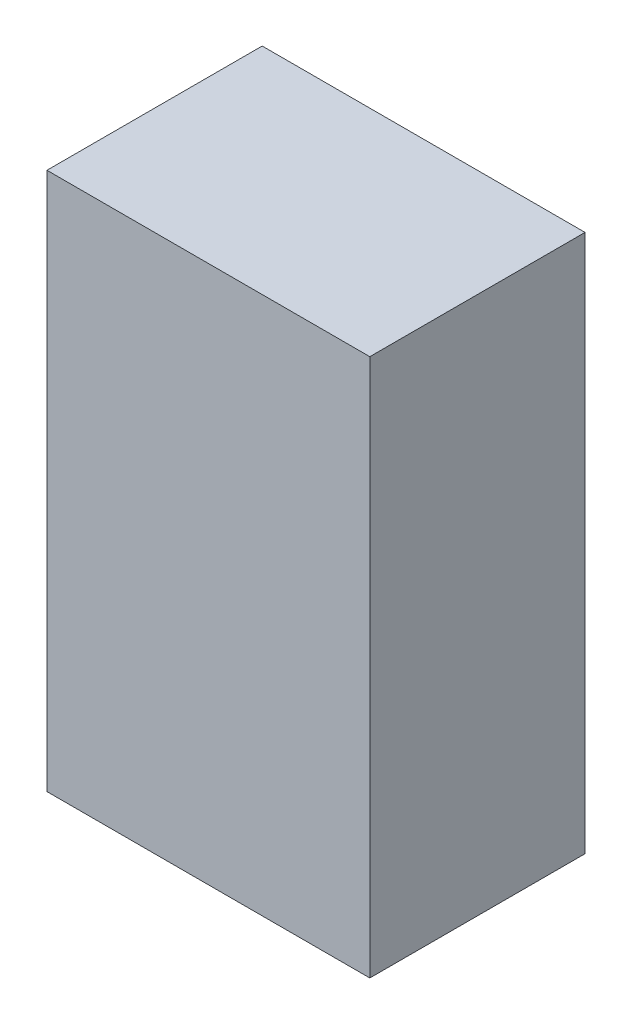
ISO-10303-21;
HEADER;
FILE_DESCRIPTION(('STEP AP214'),'2;1');
FILE_NAME('part.step','',(''),(''),'','','');
FILE_SCHEMA(('AUTOMOTIVE_DESIGN { 1 0 10303 214 1 1 1 1 }'));
ENDSEC;
DATA;
#1=APPLICATION_CONTEXT('core data for automotive mechanical design processes');
#2=APPLICATION_PROTOCOL_DEFINITION('international standard','automotive_design',2000,#1);
#3=PRODUCT_CONTEXT('',#1,'mechanical');
#4=PRODUCT('Part','Part','',(#3));
#5=PRODUCT_RELATED_PRODUCT_CATEGORY('part','',(#4));
#6=PRODUCT_DEFINITION_FORMATION('','',#4);
#7=PRODUCT_DEFINITION_CONTEXT('part definition',#1,'design');
#8=PRODUCT_DEFINITION('design','',#6,#7);
#9=PRODUCT_DEFINITION_SHAPE('','',#8);
#10=(LENGTH_UNIT() NAMED_UNIT(*) SI_UNIT(.MILLI.,.METRE.));
#11=(NAMED_UNIT(*) PLANE_ANGLE_UNIT() SI_UNIT($,.RADIAN.));
#12=(NAMED_UNIT(*) SI_UNIT($,.STERADIAN.) SOLID_ANGLE_UNIT());
#13=UNCERTAINTY_MEASURE_WITH_UNIT(LENGTH_MEASURE(1.E-05),#10,'distance_accuracy_value','');
#14=(GEOMETRIC_REPRESENTATION_CONTEXT(3) GLOBAL_UNCERTAINTY_ASSIGNED_CONTEXT((#13)) GLOBAL_UNIT_ASSIGNED_CONTEXT((#10,
#11,#12)) REPRESENTATION_CONTEXT('',''));
#15=CARTESIAN_POINT('',(0.,0.,0.));
#16=DIRECTION('',(0.,0.,1.));
#17=DIRECTION('',(1.,0.,0.));
#18=AXIS2_PLACEMENT_3D('',#15,#16,#17);
#19=CARTESIAN_POINT('',(1.650000000004,7.7216,0.77916));
#20=DIRECTION('',(2.05103E-10,0.,-1.));
#21=DIRECTION('',(-1.,0.,-2.05103E-10));
#22=AXIS2_PLACEMENT_3D('',#19,#20,#21);
#23=PLANE('',#22);
#24=DIRECTION('',(1.,0.,0.));
#25=VECTOR('',#24,1.);
#26=CARTESIAN_POINT('',(1.400000000004,8.1716,0.779159999969));
#27=LINE('',#26,#25);
#28=CARTESIAN_POINT('',(1.50000000000205,8.1716,0.779159999969));
#29=VERTEX_POINT('',#28);
#30=CARTESIAN_POINT('',(1.800000000004,8.1716,0.779159999999745));
#31=VERTEX_POINT('',#30);
#32=EDGE_CURVE('E156',#29,#31,#27,.T.);
#33=ORIENTED_EDGE('',*,*,#32,.T.);
#34=CARTESIAN_POINT('',(1.800000000004,8.0716,0.77916000003049));
#35=DIRECTION('',(2.05103E-10,0.,-1.));
#36=DIRECTION('',(-1.,0.,-2.05103E-10));
#37=AXIS2_PLACEMENT_3D('',#34,#35,#36);
#38=CIRCLE('',#37,0.1);
#39=CARTESIAN_POINT('',(1.900000000004,8.0716,0.779160000051));
#40=VERTEX_POINT('',#39);
#41=EDGE_CURVE('E20',#40,#31,#38,.F.);
#42=ORIENTED_EDGE('',*,*,#41,.F.);
#43=DIRECTION('',(0.,1.,0.));
#44=VECTOR('',#43,1.);
#45=CARTESIAN_POINT('',(1.900000000004,8.1716,0.779160000051));
#46=LINE('',#45,#44);
#47=CARTESIAN_POINT('',(1.900000000004,8.0216,0.779160000051255));
#48=VERTEX_POINT('',#47);
#49=EDGE_CURVE('E153',#40,#48,#46,.F.);
#50=ORIENTED_EDGE('',*,*,#49,.T.);
#51=CARTESIAN_POINT('',(1.800000000004,8.0216,0.779160000031));
#52=DIRECTION('',(2.05103E-10,0.,-1.));
#53=DIRECTION('',(-1.,0.,-2.05103E-10));
#54=AXIS2_PLACEMENT_3D('',#51,#52,#53);
#55=CIRCLE('',#54,0.1);
#56=CARTESIAN_POINT('',(1.80000000000205,7.9216,0.779160000031));
#57=VERTEX_POINT('',#56);
#58=EDGE_CURVE('E171',#57,#48,#55,.F.);
#59=ORIENTED_EDGE('',*,*,#58,.F.);
#60=DIRECTION('',(-1.,0.,0.));
#61=VECTOR('',#60,1.);
#62=CARTESIAN_POINT('',(1.400000000004,7.9216,0.779160000031));
#63=LINE('',#62,#61);
#64=CARTESIAN_POINT('',(1.500000000004,7.9216,0.779160000000255));
#65=VERTEX_POINT('',#64);
#66=EDGE_CURVE('E175',#57,#65,#63,.T.);
#67=ORIENTED_EDGE('',*,*,#66,.T.);
#68=CARTESIAN_POINT('',(1.500000000004,8.0216,0.77915999996951));
#69=DIRECTION('',(2.05103E-10,0.,-1.));
#70=DIRECTION('',(-1.,0.,-2.05103E-10));
#71=AXIS2_PLACEMENT_3D('',#68,#69,#70);
#72=CIRCLE('',#71,0.1);
#73=CARTESIAN_POINT('',(1.400000000004,8.0216,0.779159999949));
#74=VERTEX_POINT('',#73);
#75=EDGE_CURVE('E225',#74,#65,#72,.F.);
#76=ORIENTED_EDGE('',*,*,#75,.F.);
#77=DIRECTION('',(0.,1.,0.));
#78=VECTOR('',#77,1.);
#79=CARTESIAN_POINT('',(1.400000000004,8.1716,0.779159999949));
#80=LINE('',#79,#78);
#81=CARTESIAN_POINT('',(1.400000000004,8.0716,0.779159999948745));
#82=VERTEX_POINT('',#81);
#83=EDGE_CURVE('E224',#74,#82,#80,.T.);
#84=ORIENTED_EDGE('',*,*,#83,.T.);
#85=CARTESIAN_POINT('',(1.500000000004,8.0716,0.779159999969));
#86=DIRECTION('',(2.05103E-10,0.,-1.));
#87=DIRECTION('',(-1.,0.,-2.05103E-10));
#88=AXIS2_PLACEMENT_3D('',#85,#86,#87);
#89=CIRCLE('',#88,0.1);
#90=EDGE_CURVE('E220',#29,#82,#89,.F.);
#91=ORIENTED_EDGE('',*,*,#90,.F.);
#92=EDGE_LOOP('',(#33,#42,#50,#59,#67,#76,#84,#91));
#93=FACE_BOUND('',#92,.T.);
#94=ADVANCED_FACE('F17',(#93),#23,.T.);
#95=CARTESIAN_POINT('',(1.650000000004,7.7216,0.77916));
#96=DIRECTION('',(-2.05103E-10,0.,1.));
#97=DIRECTION('',(1.,0.,2.05103E-10));
#98=AXIS2_PLACEMENT_3D('',#95,#96,#97);
#99=PLANE('',#98);
#100=CARTESIAN_POINT('',(1.500000000004,7.3716,0.77915999996951));
#101=DIRECTION('',(2.05103E-10,0.,-1.));
#102=DIRECTION('',(-1.,0.,-2.05103E-10));
#103=AXIS2_PLACEMENT_3D('',#100,#101,#102);
#104=CIRCLE('',#103,0.1);
#105=CARTESIAN_POINT('',(1.400000000004,7.3716,0.779159999949));
#106=VERTEX_POINT('',#105);
#107=CARTESIAN_POINT('',(1.500000000004,7.2716,0.779160000000255));
#108=VERTEX_POINT('',#107);
#109=EDGE_CURVE('E216',#106,#108,#104,.F.);
#110=ORIENTED_EDGE('',*,*,#109,.F.);
#111=DIRECTION('',(0.,1.,0.));
#112=VECTOR('',#111,1.);
#113=CARTESIAN_POINT('',(1.400000000004,7.2716,0.779159999949));
#114=LINE('',#113,#112);
#115=CARTESIAN_POINT('',(1.400000000004,7.4216,0.779159999948745));
#116=VERTEX_POINT('',#115);
#117=EDGE_CURVE('E215',#106,#116,#114,.T.);
#118=ORIENTED_EDGE('',*,*,#117,.T.);
#119=CARTESIAN_POINT('',(1.500000000004,7.4216,0.779159999969));
#120=DIRECTION('',(2.05103E-10,0.,-1.));
#121=DIRECTION('',(-1.,0.,-2.05103E-10));
#122=AXIS2_PLACEMENT_3D('',#119,#120,#121);
#123=CIRCLE('',#122,0.1);
#124=CARTESIAN_POINT('',(1.50000000000205,7.5216,0.779159999969));
#125=VERTEX_POINT('',#124);
#126=EDGE_CURVE('E211',#125,#116,#123,.F.);
#127=ORIENTED_EDGE('',*,*,#126,.F.);
#128=DIRECTION('',(1.,0.,0.));
#129=VECTOR('',#128,1.);
#130=CARTESIAN_POINT('',(1.400000000004,7.5216,0.779159999969));
#131=LINE('',#130,#129);
#132=CARTESIAN_POINT('',(1.800000000004,7.5216,0.779159999999745));
#133=VERTEX_POINT('',#132);
#134=EDGE_CURVE('E210',#125,#133,#131,.T.);
#135=ORIENTED_EDGE('',*,*,#134,.T.);
#136=CARTESIAN_POINT('',(1.800000000004,7.4216,0.77916000003049));
#137=DIRECTION('',(2.05103E-10,0.,-1.));
#138=DIRECTION('',(-1.,0.,-2.05103E-10));
#139=AXIS2_PLACEMENT_3D('',#136,#137,#138);
#140=CIRCLE('',#139,0.1);
#141=CARTESIAN_POINT('',(1.900000000004,7.4216,0.779160000051));
#142=VERTEX_POINT('',#141);
#143=EDGE_CURVE('E206',#142,#133,#140,.F.);
#144=ORIENTED_EDGE('',*,*,#143,.F.);
#145=DIRECTION('',(0.,1.,0.));
#146=VECTOR('',#145,1.);
#147=CARTESIAN_POINT('',(1.900000000004,7.2716,0.779160000051));
#148=LINE('',#147,#146);
#149=CARTESIAN_POINT('',(1.900000000004,7.3716,0.779160000051255));
#150=VERTEX_POINT('',#149);
#151=EDGE_CURVE('E205',#142,#150,#148,.F.);
#152=ORIENTED_EDGE('',*,*,#151,.T.);
#153=CARTESIAN_POINT('',(1.800000000004,7.3716,0.779160000031));
#154=DIRECTION('',(2.05103E-10,0.,-1.));
#155=DIRECTION('',(-1.,0.,-2.05103E-10));
#156=AXIS2_PLACEMENT_3D('',#153,#154,#155);
#157=CIRCLE('',#156,0.1);
#158=CARTESIAN_POINT('',(1.80000000000205,7.2716,0.779160000031));
#159=VERTEX_POINT('',#158);
#160=EDGE_CURVE('E201',#159,#150,#157,.F.);
#161=ORIENTED_EDGE('',*,*,#160,.F.);
#162=DIRECTION('',(1.,0.,0.));
#163=VECTOR('',#162,1.);
#164=CARTESIAN_POINT('',(1.400000000004,7.2716,0.779160000031));
#165=LINE('',#164,#163);
#166=EDGE_CURVE('E243',#159,#108,#165,.F.);
#167=ORIENTED_EDGE('',*,*,#166,.T.);
#168=EDGE_LOOP('',(#110,#118,#127,#135,#144,#152,#161,#167));
#169=FACE_BOUND('',#168,.T.);
#170=ADVANCED_FACE('F522',(#169),#99,.F.);
#171=CARTESIAN_POINT('',(1.800000000004,8.0716,0.779160000031));
#172=DIRECTION('',(2.05103E-10,0.,-1.));
#173=DIRECTION('',(-1.,0.,-2.05103E-10));
#174=AXIS2_PLACEMENT_3D('',#171,#172,#173);
#175=CYLINDRICAL_SURFACE('',#174,0.1);
#176=CARTESIAN_POINT('',(1.7999999999999,8.0716,0.799160000031));
#177=DIRECTION('',(2.05103E-10,0.,-1.));
#178=DIRECTION('',(-1.,0.,-2.05103E-10));
#179=AXIS2_PLACEMENT_3D('',#176,#177,#178);
#180=CIRCLE('',#179,0.1);
#181=CARTESIAN_POINT('',(1.80000000000195,8.1716,0.799160000030883));
#182=VERTEX_POINT('',#181);
#183=CARTESIAN_POINT('',(1.89999999999992,8.0716,0.799160000051393));
#184=VERTEX_POINT('',#183);
#185=EDGE_CURVE('E163',#182,#184,#180,.T.);
#186=ORIENTED_EDGE('',*,*,#185,.T.);
#187=DIRECTION('',(-2.05103E-10,0.,1.));
#188=VECTOR('',#187,1.);
#189=CARTESIAN_POINT('',(1.900000000004,8.0716,0.779160000051));
#190=LINE('',#189,#188);
#191=EDGE_CURVE('E159',#184,#40,#190,.F.);
#192=ORIENTED_EDGE('',*,*,#191,.T.);
#193=ORIENTED_EDGE('',*,*,#41,.T.);
#194=DIRECTION('',(0.,0.,-1.));
#195=VECTOR('',#194,1.);
#196=CARTESIAN_POINT('',(1.800000000004,8.1716,0.779159999949));
#197=LINE('',#196,#195);
#198=EDGE_CURVE('E258',#31,#182,#197,.F.);
#199=ORIENTED_EDGE('',*,*,#198,.T.);
#200=EDGE_LOOP('',(#186,#192,#193,#199));
#201=FACE_BOUND('',#200,.T.);
#202=ADVANCED_FACE('F161',(#201),#175,.T.);
#203=CARTESIAN_POINT('',(1.900000000004,8.1716,0.779160000051));
#204=DIRECTION('',(-1.,0.,-2.05103E-10));
#205=DIRECTION('',(-2.05103E-10,0.,1.));
#206=AXIS2_PLACEMENT_3D('',#203,#204,#205);
#207=PLANE('',#206);
#208=DIRECTION('',(2.05103E-10,0.,-1.));
#209=VECTOR('',#208,1.);
#210=CARTESIAN_POINT('',(1.900000000004,8.0216,0.77916000005151));
#211=LINE('',#210,#209);
#212=CARTESIAN_POINT('',(1.89999999999997,8.0216,0.799160000051138));
#213=VERTEX_POINT('',#212);
#214=EDGE_CURVE('E169',#48,#213,#211,.F.);
#215=ORIENTED_EDGE('',*,*,#214,.F.);
#216=ORIENTED_EDGE('',*,*,#49,.F.);
#217=ORIENTED_EDGE('',*,*,#191,.F.);
#218=DIRECTION('',(0.,1.,0.));
#219=VECTOR('',#218,1.);
#220=CARTESIAN_POINT('',(1.9,7.7216,0.799160000051276));
#221=LINE('',#220,#219);
#222=EDGE_CURVE('E198',#184,#213,#221,.F.);
#223=ORIENTED_EDGE('',*,*,#222,.T.);
#224=EDGE_LOOP('',(#215,#216,#217,#223));
#225=FACE_BOUND('',#224,.T.);
#226=ADVANCED_FACE('F167',(#225),#207,.F.);
#227=CARTESIAN_POINT('',(1.800000000004,8.0216,0.779160000031));
#228=DIRECTION('',(2.05103E-10,0.,-1.));
#229=DIRECTION('',(-1.,0.,-2.05103E-10));
#230=AXIS2_PLACEMENT_3D('',#227,#228,#229);
#231=CYLINDRICAL_SURFACE('',#230,0.1);
#232=CARTESIAN_POINT('',(1.7999999999999,8.0216,0.79916000003049));
#233=DIRECTION('',(2.05103E-10,0.,-1.));
#234=DIRECTION('',(-1.,0.,-2.05103E-10));
#235=AXIS2_PLACEMENT_3D('',#232,#233,#234);
#236=CIRCLE('',#235,0.1);
#237=CARTESIAN_POINT('',(1.79999999999995,7.9216,0.799160000030628));
#238=VERTEX_POINT('',#237);
#239=EDGE_CURVE('E196',#213,#238,#236,.T.);
#240=ORIENTED_EDGE('',*,*,#239,.T.);
#241=DIRECTION('',(0.,0.,1.));
#242=VECTOR('',#241,1.);
#243=CARTESIAN_POINT('',(1.8,7.9216,0.779159999949));
#244=LINE('',#243,#242);
#245=EDGE_CURVE('E233',#238,#57,#244,.F.);
#246=ORIENTED_EDGE('',*,*,#245,.T.);
#247=ORIENTED_EDGE('',*,*,#58,.T.);
#248=ORIENTED_EDGE('',*,*,#214,.T.);
#249=EDGE_LOOP('',(#240,#246,#247,#248));
#250=FACE_BOUND('',#249,.T.);
#251=ADVANCED_FACE('F499',(#250),#231,.T.);
#252=CARTESIAN_POINT('',(1.400000000004,7.9216,0.779159999949));
#253=DIRECTION('',(0.,1.,0.));
#254=DIRECTION('',(-1.,0.,0.));
#255=AXIS2_PLACEMENT_3D('',#252,#253,#254);
#256=PLANE('',#255);
#257=ORIENTED_EDGE('',*,*,#245,.F.);
#258=DIRECTION('',(1.,0.,2.05103E-10));
#259=VECTOR('',#258,1.);
#260=CARTESIAN_POINT('',(1.65,7.9216,0.79916));
#261=LINE('',#260,#259);
#262=CARTESIAN_POINT('',(1.4999999999999,7.9216,0.799159999969117));
#263=VERTEX_POINT('',#262);
#264=EDGE_CURVE('E195',#238,#263,#261,.F.);
#265=ORIENTED_EDGE('',*,*,#264,.T.);
#266=DIRECTION('',(2.05103E-10,0.,-1.));
#267=VECTOR('',#266,1.);
#268=CARTESIAN_POINT('',(1.500000000004,7.9216,0.779159999969));
#269=LINE('',#268,#267);
#270=EDGE_CURVE('E227',#65,#263,#269,.F.);
#271=ORIENTED_EDGE('',*,*,#270,.F.);
#272=ORIENTED_EDGE('',*,*,#66,.F.);
#273=EDGE_LOOP('',(#257,#265,#271,#272));
#274=FACE_BOUND('',#273,.T.);
#275=ADVANCED_FACE('F491',(#274),#256,.F.);
#276=CARTESIAN_POINT('',(1.500000000004,8.0216,0.779159999969));
#277=DIRECTION('',(2.05103E-10,0.,-1.));
#278=DIRECTION('',(-1.,0.,-2.05103E-10));
#279=AXIS2_PLACEMENT_3D('',#276,#277,#278);
#280=CYLINDRICAL_SURFACE('',#279,0.1);
#281=CARTESIAN_POINT('',(1.4999999999999,8.0216,0.799159999969));
#282=DIRECTION('',(2.05103E-10,0.,-1.));
#283=DIRECTION('',(-1.,0.,-2.05103E-10));
#284=AXIS2_PLACEMENT_3D('',#281,#282,#283);
#285=CIRCLE('',#284,0.1);
#286=CARTESIAN_POINT('',(1.39999999999992,8.0216,0.799159999948607));
#287=VERTEX_POINT('',#286);
#288=EDGE_CURVE('E193',#263,#287,#285,.T.);
#289=ORIENTED_EDGE('',*,*,#288,.T.);
#290=DIRECTION('',(2.05103E-10,0.,-1.));
#291=VECTOR('',#290,1.);
#292=CARTESIAN_POINT('',(1.400000000004,8.0216,0.779159999949));
#293=LINE('',#292,#291);
#294=EDGE_CURVE('E231',#287,#74,#293,.T.);
#295=ORIENTED_EDGE('',*,*,#294,.T.);
#296=ORIENTED_EDGE('',*,*,#75,.T.);
#297=ORIENTED_EDGE('',*,*,#270,.T.);
#298=EDGE_LOOP('',(#289,#295,#296,#297));
#299=FACE_BOUND('',#298,.T.);
#300=ADVANCED_FACE('F482',(#299),#280,.T.);
#301=CARTESIAN_POINT('',(1.400000000004,8.1716,0.779159999949));
#302=DIRECTION('',(1.,0.,2.05103E-10));
#303=DIRECTION('',(2.05103E-10,0.,-1.));
#304=AXIS2_PLACEMENT_3D('',#301,#302,#303);
#305=PLANE('',#304);
#306=ORIENTED_EDGE('',*,*,#294,.F.);
#307=DIRECTION('',(0.,1.,0.));
#308=VECTOR('',#307,1.);
#309=CARTESIAN_POINT('',(1.4,7.7216,0.799159999948724));
#310=LINE('',#309,#308);
#311=CARTESIAN_POINT('',(1.39999999999992,8.0716,0.799159999948862));
#312=VERTEX_POINT('',#311);
#313=EDGE_CURVE('E192',#287,#312,#310,.T.);
#314=ORIENTED_EDGE('',*,*,#313,.T.);
#315=DIRECTION('',(2.05103E-10,0.,-1.));
#316=VECTOR('',#315,1.);
#317=CARTESIAN_POINT('',(1.400000000004,8.0716,0.77915999994849));
#318=LINE('',#317,#316);
#319=EDGE_CURVE('E223',#82,#312,#318,.F.);
#320=ORIENTED_EDGE('',*,*,#319,.F.);
#321=ORIENTED_EDGE('',*,*,#83,.F.);
#322=EDGE_LOOP('',(#306,#314,#320,#321));
#323=FACE_BOUND('',#322,.T.);
#324=ADVANCED_FACE('F473',(#323),#305,.F.);
#325=CARTESIAN_POINT('',(1.500000000004,8.0716,0.779159999969));
#326=DIRECTION('',(2.05103E-10,0.,-1.));
#327=DIRECTION('',(-1.,0.,-2.05103E-10));
#328=AXIS2_PLACEMENT_3D('',#325,#326,#327);
#329=CYLINDRICAL_SURFACE('',#328,0.1);
#330=CARTESIAN_POINT('',(1.4999999999999,8.0716,0.79915999996951));
#331=DIRECTION('',(2.05103E-10,0.,-1.));
#332=DIRECTION('',(-1.,0.,-2.05103E-10));
#333=AXIS2_PLACEMENT_3D('',#330,#331,#332);
#334=CIRCLE('',#333,0.1);
#335=CARTESIAN_POINT('',(1.49999999999995,8.1716,0.799159999969372));
#336=VERTEX_POINT('',#335);
#337=EDGE_CURVE('E190',#312,#336,#334,.T.);
#338=ORIENTED_EDGE('',*,*,#337,.T.);
#339=DIRECTION('',(0.,0.,-1.));
#340=VECTOR('',#339,1.);
#341=CARTESIAN_POINT('',(1.5,8.1716,0.779159999949));
#342=LINE('',#341,#340);
#343=EDGE_CURVE('E251',#336,#29,#342,.T.);
#344=ORIENTED_EDGE('',*,*,#343,.T.);
#345=ORIENTED_EDGE('',*,*,#90,.T.);
#346=ORIENTED_EDGE('',*,*,#319,.T.);
#347=EDGE_LOOP('',(#338,#344,#345,#346));
#348=FACE_BOUND('',#347,.T.);
#349=ADVANCED_FACE('F464',(#348),#329,.T.);
#350=CARTESIAN_POINT('',(1.400000000004,8.1716,0.779159999949));
#351=DIRECTION('',(0.,-1.,0.));
#352=DIRECTION('',(0.,0.,-1.));
#353=AXIS2_PLACEMENT_3D('',#350,#351,#352);
#354=PLANE('',#353);
#355=ORIENTED_EDGE('',*,*,#343,.F.);
#356=DIRECTION('',(1.,0.,2.05103E-10));
#357=VECTOR('',#356,1.);
#358=CARTESIAN_POINT('',(1.65,8.1716,0.79916));
#359=LINE('',#358,#357);
#360=EDGE_CURVE('E189',#336,#182,#359,.T.);
#361=ORIENTED_EDGE('',*,*,#360,.T.);
#362=ORIENTED_EDGE('',*,*,#198,.F.);
#363=ORIENTED_EDGE('',*,*,#32,.F.);
#364=EDGE_LOOP('',(#355,#361,#362,#363));
#365=FACE_BOUND('',#364,.T.);
#366=ADVANCED_FACE('F455',(#365),#354,.F.);
#367=CARTESIAN_POINT('',(1.500000000004,7.3716,0.779159999969));
#368=DIRECTION('',(2.05103E-10,0.,-1.));
#369=DIRECTION('',(-1.,0.,-2.05103E-10));
#370=AXIS2_PLACEMENT_3D('',#367,#368,#369);
#371=CYLINDRICAL_SURFACE('',#370,0.1);
#372=CARTESIAN_POINT('',(1.4999999999999,7.3716,0.799159999969));
#373=DIRECTION('',(2.05103E-10,0.,-1.));
#374=DIRECTION('',(-1.,0.,-2.05103E-10));
#375=AXIS2_PLACEMENT_3D('',#372,#373,#374);
#376=CIRCLE('',#375,0.1);
#377=CARTESIAN_POINT('',(1.50000000000195,7.2716,0.799159999969117));
#378=VERTEX_POINT('',#377);
#379=CARTESIAN_POINT('',(1.39999999999992,7.3716,0.799159999948607));
#380=VERTEX_POINT('',#379);
#381=EDGE_CURVE('E187',#378,#380,#376,.T.);
#382=ORIENTED_EDGE('',*,*,#381,.T.);
#383=DIRECTION('',(2.05103E-10,0.,-1.));
#384=VECTOR('',#383,1.);
#385=CARTESIAN_POINT('',(1.400000000004,7.3716,0.779159999949));
#386=LINE('',#385,#384);
#387=EDGE_CURVE('E219',#380,#106,#386,.T.);
#388=ORIENTED_EDGE('',*,*,#387,.T.);
#389=ORIENTED_EDGE('',*,*,#109,.T.);
#390=DIRECTION('',(0.,0.,1.));
#391=VECTOR('',#390,1.);
#392=CARTESIAN_POINT('',(1.500000000004,7.2716,0.779159999949));
#393=LINE('',#392,#391);
#394=EDGE_CURVE('E200',#108,#378,#393,.T.);
#395=ORIENTED_EDGE('',*,*,#394,.T.);
#396=EDGE_LOOP('',(#382,#388,#389,#395));
#397=FACE_BOUND('',#396,.T.);
#398=ADVANCED_FACE('F446',(#397),#371,.T.);
#399=CARTESIAN_POINT('',(1.400000000004,7.2716,0.779159999949));
#400=DIRECTION('',(1.,0.,2.05103E-10));
#401=DIRECTION('',(2.05103E-10,0.,-1.));
#402=AXIS2_PLACEMENT_3D('',#399,#400,#401);
#403=PLANE('',#402);
#404=ORIENTED_EDGE('',*,*,#387,.F.);
#405=DIRECTION('',(0.,1.,0.));
#406=VECTOR('',#405,1.);
#407=CARTESIAN_POINT('',(1.4,7.7216,0.799159999948724));
#408=LINE('',#407,#406);
#409=CARTESIAN_POINT('',(1.39999999999992,7.4216,0.799159999948862));
#410=VERTEX_POINT('',#409);
#411=EDGE_CURVE('E186',#380,#410,#408,.T.);
#412=ORIENTED_EDGE('',*,*,#411,.T.);
#413=DIRECTION('',(2.05103E-10,0.,-1.));
#414=VECTOR('',#413,1.);
#415=CARTESIAN_POINT('',(1.400000000004,7.4216,0.77915999994849));
#416=LINE('',#415,#414);
#417=EDGE_CURVE('E214',#116,#410,#416,.F.);
#418=ORIENTED_EDGE('',*,*,#417,.F.);
#419=ORIENTED_EDGE('',*,*,#117,.F.);
#420=EDGE_LOOP('',(#404,#412,#418,#419));
#421=FACE_BOUND('',#420,.T.);
#422=ADVANCED_FACE('F437',(#421),#403,.F.);
#423=CARTESIAN_POINT('',(1.500000000004,7.4216,0.779159999969));
#424=DIRECTION('',(2.05103E-10,0.,-1.));
#425=DIRECTION('',(-1.,0.,-2.05103E-10));
#426=AXIS2_PLACEMENT_3D('',#423,#424,#425);
#427=CYLINDRICAL_SURFACE('',#426,0.1);
#428=CARTESIAN_POINT('',(1.4999999999999,7.4216,0.79915999996951));
#429=DIRECTION('',(2.05103E-10,0.,-1.));
#430=DIRECTION('',(-1.,0.,-2.05103E-10));
#431=AXIS2_PLACEMENT_3D('',#428,#429,#430);
#432=CIRCLE('',#431,0.1);
#433=CARTESIAN_POINT('',(1.49999999999995,7.5216,0.799159999969372));
#434=VERTEX_POINT('',#433);
#435=EDGE_CURVE('E184',#410,#434,#432,.T.);
#436=ORIENTED_EDGE('',*,*,#435,.T.);
#437=DIRECTION('',(0.,0.,1.));
#438=VECTOR('',#437,1.);
#439=CARTESIAN_POINT('',(1.5,7.5216,0.779159999949));
#440=LINE('',#439,#438);
#441=EDGE_CURVE('E249',#434,#125,#440,.F.);
#442=ORIENTED_EDGE('',*,*,#441,.T.);
#443=ORIENTED_EDGE('',*,*,#126,.T.);
#444=ORIENTED_EDGE('',*,*,#417,.T.);
#445=EDGE_LOOP('',(#436,#442,#443,#444));
#446=FACE_BOUND('',#445,.T.);
#447=ADVANCED_FACE('F428',(#446),#427,.T.);
#448=CARTESIAN_POINT('',(1.400000000004,7.5216,0.779159999949));
#449=DIRECTION('',(0.,-1.,0.));
#450=DIRECTION('',(1.,0.,0.));
#451=AXIS2_PLACEMENT_3D('',#448,#449,#450);
#452=PLANE('',#451);
#453=ORIENTED_EDGE('',*,*,#441,.F.);
#454=DIRECTION('',(1.,0.,2.05103E-10));
#455=VECTOR('',#454,1.);
#456=CARTESIAN_POINT('',(1.65,7.5216,0.79916));
#457=LINE('',#456,#455);
#458=CARTESIAN_POINT('',(1.7999999999999,7.5216,0.799160000030883));
#459=VERTEX_POINT('',#458);
#460=EDGE_CURVE('E183',#434,#459,#457,.T.);
#461=ORIENTED_EDGE('',*,*,#460,.T.);
#462=DIRECTION('',(2.05103E-10,0.,-1.));
#463=VECTOR('',#462,1.);
#464=CARTESIAN_POINT('',(1.800000000004,7.5216,0.779160000031));
#465=LINE('',#464,#463);
#466=EDGE_CURVE('E209',#133,#459,#465,.F.);
#467=ORIENTED_EDGE('',*,*,#466,.F.);
#468=ORIENTED_EDGE('',*,*,#134,.F.);
#469=EDGE_LOOP('',(#453,#461,#467,#468));
#470=FACE_BOUND('',#469,.T.);
#471=ADVANCED_FACE('F419',(#470),#452,.F.);
#472=CARTESIAN_POINT('',(1.800000000004,7.4216,0.779160000031));
#473=DIRECTION('',(2.05103E-10,0.,-1.));
#474=DIRECTION('',(-1.,0.,-2.05103E-10));
#475=AXIS2_PLACEMENT_3D('',#472,#473,#474);
#476=CYLINDRICAL_SURFACE('',#475,0.1);
#477=CARTESIAN_POINT('',(1.7999999999999,7.4216,0.799160000031));
#478=DIRECTION('',(2.05103E-10,0.,-1.));
#479=DIRECTION('',(-1.,0.,-2.05103E-10));
#480=AXIS2_PLACEMENT_3D('',#477,#478,#479);
#481=CIRCLE('',#480,0.1);
#482=CARTESIAN_POINT('',(1.89999999999992,7.4216,0.799160000051393));
#483=VERTEX_POINT('',#482);
#484=EDGE_CURVE('E181',#459,#483,#481,.T.);
#485=ORIENTED_EDGE('',*,*,#484,.T.);
#486=DIRECTION('',(-2.05103E-10,0.,1.));
#487=VECTOR('',#486,1.);
#488=CARTESIAN_POINT('',(1.900000000004,7.4216,0.779160000051));
#489=LINE('',#488,#487);
#490=EDGE_CURVE('E247',#483,#142,#489,.F.);
#491=ORIENTED_EDGE('',*,*,#490,.T.);
#492=ORIENTED_EDGE('',*,*,#143,.T.);
#493=ORIENTED_EDGE('',*,*,#466,.T.);
#494=EDGE_LOOP('',(#485,#491,#492,#493));
#495=FACE_BOUND('',#494,.T.);
#496=ADVANCED_FACE('F410',(#495),#476,.T.);
#497=CARTESIAN_POINT('',(1.900000000004,7.2716,0.779160000051));
#498=DIRECTION('',(-1.,0.,-2.05103E-10));
#499=DIRECTION('',(-2.05103E-10,0.,1.));
#500=AXIS2_PLACEMENT_3D('',#497,#498,#499);
#501=PLANE('',#500);
#502=ORIENTED_EDGE('',*,*,#490,.F.);
#503=DIRECTION('',(0.,1.,0.));
#504=VECTOR('',#503,1.);
#505=CARTESIAN_POINT('',(1.9,7.7216,0.799160000051276));
#506=LINE('',#505,#504);
#507=CARTESIAN_POINT('',(1.89999999999997,7.3716,0.799160000051138));
#508=VERTEX_POINT('',#507);
#509=EDGE_CURVE('E180',#483,#508,#506,.F.);
#510=ORIENTED_EDGE('',*,*,#509,.T.);
#511=DIRECTION('',(2.05103E-10,0.,-1.));
#512=VECTOR('',#511,1.);
#513=CARTESIAN_POINT('',(1.900000000004,7.3716,0.77916000005151));
#514=LINE('',#513,#512);
#515=EDGE_CURVE('E204',#150,#508,#514,.F.);
#516=ORIENTED_EDGE('',*,*,#515,.F.);
#517=ORIENTED_EDGE('',*,*,#151,.F.);
#518=EDGE_LOOP('',(#502,#510,#516,#517));
#519=FACE_BOUND('',#518,.T.);
#520=ADVANCED_FACE('F401',(#519),#501,.F.);
#521=CARTESIAN_POINT('',(1.800000000004,7.3716,0.779160000031));
#522=DIRECTION('',(2.05103E-10,0.,-1.));
#523=DIRECTION('',(-1.,0.,-2.05103E-10));
#524=AXIS2_PLACEMENT_3D('',#521,#522,#523);
#525=CYLINDRICAL_SURFACE('',#524,0.1);
#526=CARTESIAN_POINT('',(1.7999999999999,7.3716,0.79916000003049));
#527=DIRECTION('',(2.05103E-10,0.,-1.));
#528=DIRECTION('',(-1.,0.,-2.05103E-10));
#529=AXIS2_PLACEMENT_3D('',#526,#527,#528);
#530=CIRCLE('',#529,0.1);
#531=CARTESIAN_POINT('',(1.79999999999995,7.2716,0.799160000030628));
#532=VERTEX_POINT('',#531);
#533=EDGE_CURVE('E177',#508,#532,#530,.T.);
#534=ORIENTED_EDGE('',*,*,#533,.T.);
#535=DIRECTION('',(0.,0.,1.));
#536=VECTOR('',#535,1.);
#537=CARTESIAN_POINT('',(1.8,7.2716,0.779159999949));
#538=LINE('',#537,#536);
#539=EDGE_CURVE('E245',#532,#159,#538,.F.);
#540=ORIENTED_EDGE('',*,*,#539,.T.);
#541=ORIENTED_EDGE('',*,*,#160,.T.);
#542=ORIENTED_EDGE('',*,*,#515,.T.);
#543=EDGE_LOOP('',(#534,#540,#541,#542));
#544=FACE_BOUND('',#543,.T.);
#545=ADVANCED_FACE('F392',(#544),#525,.T.);
#546=CARTESIAN_POINT('',(1.400000000004,7.2716,0.779159999949));
#547=DIRECTION('',(0.,1.,0.));
#548=DIRECTION('',(0.,0.,1.));
#549=AXIS2_PLACEMENT_3D('',#546,#547,#548);
#550=PLANE('',#549);
#551=ORIENTED_EDGE('',*,*,#394,.F.);
#552=ORIENTED_EDGE('',*,*,#166,.F.);
#553=ORIENTED_EDGE('',*,*,#539,.F.);
#554=DIRECTION('',(1.,0.,2.05103E-10));
#555=VECTOR('',#554,1.);
#556=CARTESIAN_POINT('',(1.65,7.2716,0.79916));
#557=LINE('',#556,#555);
#558=EDGE_CURVE('E179',#532,#378,#557,.F.);
#559=ORIENTED_EDGE('',*,*,#558,.T.);
#560=EDGE_LOOP('',(#551,#552,#553,#559));
#561=FACE_BOUND('',#560,.T.);
#562=ADVANCED_FACE('F337',(#561),#550,.F.);
#563=CARTESIAN_POINT('',(1.65,7.7216,0.79916));
#564=DIRECTION('',(-2.05103E-10,0.,1.));
#565=DIRECTION('',(1.,0.,2.05103E-10));
#566=AXIS2_PLACEMENT_3D('',#563,#564,#565);
#567=PLANE('',#566);
#568=ORIENTED_EDGE('',*,*,#533,.F.);
#569=ORIENTED_EDGE('',*,*,#509,.F.);
#570=ORIENTED_EDGE('',*,*,#484,.F.);
#571=ORIENTED_EDGE('',*,*,#460,.F.);
#572=ORIENTED_EDGE('',*,*,#435,.F.);
#573=ORIENTED_EDGE('',*,*,#411,.F.);
#574=ORIENTED_EDGE('',*,*,#381,.F.);
#575=ORIENTED_EDGE('',*,*,#558,.F.);
#576=EDGE_LOOP('',(#568,#569,#570,#571,#572,#573,#574,#575));
#577=FACE_BOUND('',#576,.T.);
#578=ORIENTED_EDGE('',*,*,#337,.F.);
#579=ORIENTED_EDGE('',*,*,#313,.F.);
#580=ORIENTED_EDGE('',*,*,#288,.F.);
#581=ORIENTED_EDGE('',*,*,#264,.F.);
#582=ORIENTED_EDGE('',*,*,#239,.F.);
#583=ORIENTED_EDGE('',*,*,#222,.F.);
#584=ORIENTED_EDGE('',*,*,#185,.F.);
#585=ORIENTED_EDGE('',*,*,#360,.F.);
#586=EDGE_LOOP('',(#578,#579,#580,#581,#582,#583,#584,#585));
#587=FACE_BOUND('',#586,.T.);
#588=DIRECTION('',(1.,0.,0.));
#589=VECTOR('',#588,1.);
#590=CARTESIAN_POINT('',(1.949999999918,8.2216,0.799159999938));
#591=LINE('',#590,#589);
#592=CARTESIAN_POINT('',(1.34999999997952,8.2216,0.799159999938117));
#593=VERTEX_POINT('',#592);
#594=CARTESIAN_POINT('',(1.95000000000002,8.2216,0.799160000030883));
#595=VERTEX_POINT('',#594);
#596=EDGE_CURVE('E303',#593,#595,#591,.T.);
#597=ORIENTED_EDGE('',*,*,#596,.T.);
#598=DIRECTION('',(0.,1.,0.));
#599=VECTOR('',#598,1.);
#600=CARTESIAN_POINT('',(1.95000000000004,7.2216,0.799160000062));
#601=LINE('',#600,#599);
#602=CARTESIAN_POINT('',(1.94999999995901,7.2216,0.799160000061883));
#603=VERTEX_POINT('',#602);
#604=EDGE_CURVE('E296',#595,#603,#601,.F.);
#605=ORIENTED_EDGE('',*,*,#604,.T.);
#606=DIRECTION('',(1.,0.,0.));
#607=VECTOR('',#606,1.);
#608=CARTESIAN_POINT('',(1.949999999918,7.2216,0.799160000062));
#609=LINE('',#608,#607);
#610=CARTESIAN_POINT('',(1.35000000000002,7.2216,0.799159999969117));
#611=VERTEX_POINT('',#610);
#612=EDGE_CURVE('E291',#603,#611,#609,.F.);
#613=ORIENTED_EDGE('',*,*,#612,.T.);
#614=DIRECTION('',(0.,1.,0.));
#615=VECTOR('',#614,1.);
#616=CARTESIAN_POINT('',(1.35000000000004,7.2216,0.799159999938));
#617=LINE('',#616,#615);
#618=EDGE_CURVE('E287',#611,#593,#617,.T.);
#619=ORIENTED_EDGE('',*,*,#618,.T.);
#620=EDGE_LOOP('',(#597,#605,#613,#619));
#621=FACE_BOUND('',#620,.T.);
#622=ADVANCED_FACE('F322',(#577,#587,#621),#567,.F.);
#623=CARTESIAN_POINT('',(1.349999999918,7.2216,1.199159999938));
#624=DIRECTION('',(1.,0.,2.05103E-10));
#625=DIRECTION('',(2.05103E-10,0.,-1.));
#626=AXIS2_PLACEMENT_3D('',#623,#624,#625);
#627=PLANE('',#626);
#628=DIRECTION('',(0.,0.,1.));
#629=VECTOR('',#628,1.);
#630=CARTESIAN_POINT('',(1.35,7.2216,1.199160000062));
#631=LINE('',#630,#629);
#632=CARTESIAN_POINT('',(1.3499999999385,7.2216,1.19915999993812));
#633=VERTEX_POINT('',#632);
#634=EDGE_CURVE('E289',#611,#633,#631,.T.);
#635=ORIENTED_EDGE('',*,*,#634,.T.);
#636=DIRECTION('',(0.,1.,0.));
#637=VECTOR('',#636,1.);
#638=CARTESIAN_POINT('',(1.349999999918,7.7216,1.19915999993847));
#639=LINE('',#638,#637);
#640=CARTESIAN_POINT('',(1.349999999918,8.2216,1.19915999996912));
#641=VERTEX_POINT('',#640);
#642=EDGE_CURVE('E306',#641,#633,#639,.F.);
#643=ORIENTED_EDGE('',*,*,#642,.F.);
#644=DIRECTION('',(0.,0.,-1.));
#645=VECTOR('',#644,1.);
#646=CARTESIAN_POINT('',(1.349999999918,8.2216,1.199160000062));
#647=LINE('',#646,#645);
#648=EDGE_CURVE('E300',#641,#593,#647,.T.);
#649=ORIENTED_EDGE('',*,*,#648,.T.);
#650=ORIENTED_EDGE('',*,*,#618,.F.);
#651=EDGE_LOOP('',(#635,#643,#649,#650));
#652=FACE_BOUND('',#651,.T.);
#653=ADVANCED_FACE('F328',(#652),#627,.F.);
#654=CARTESIAN_POINT('',(1.949999999918,7.2216,1.199160000062));
#655=DIRECTION('',(0.,1.,0.));
#656=DIRECTION('',(0.,0.,1.));
#657=AXIS2_PLACEMENT_3D('',#654,#655,#656);
#658=PLANE('',#657);
#659=DIRECTION('',(-2.05103E-10,0.,1.));
#660=VECTOR('',#659,1.);
#661=CARTESIAN_POINT('',(1.949999999918,7.2216,1.199160000062));
#662=LINE('',#661,#660);
#663=CARTESIAN_POINT('',(1.949999999918,7.2216,1.19915999999988));
#664=VERTEX_POINT('',#663);
#665=EDGE_CURVE('E294',#603,#664,#662,.T.);
#666=ORIENTED_EDGE('',*,*,#665,.T.);
#667=DIRECTION('',(1.,0.,2.05103E-10));
#668=VECTOR('',#667,1.);
#669=CARTESIAN_POINT('',(1.649999999918,7.2216,1.19916));
#670=LINE('',#669,#668);
#671=EDGE_CURVE('E309',#633,#664,#670,.T.);
#672=ORIENTED_EDGE('',*,*,#671,.F.);
#673=ORIENTED_EDGE('',*,*,#634,.F.);
#674=ORIENTED_EDGE('',*,*,#612,.F.);
#675=EDGE_LOOP('',(#666,#672,#673,#674));
#676=FACE_BOUND('',#675,.T.);
#677=ADVANCED_FACE('F319',(#676),#658,.F.);
#678=CARTESIAN_POINT('',(1.949999999918,7.2216,1.199160000062));
#679=DIRECTION('',(-1.,0.,-2.05103E-10));
#680=DIRECTION('',(-2.05103E-10,0.,1.));
#681=AXIS2_PLACEMENT_3D('',#678,#679,#680);
#682=PLANE('',#681);
#683=DIRECTION('',(0.,0.,-1.));
#684=VECTOR('',#683,1.);
#685=CARTESIAN_POINT('',(1.95,8.2216,1.199160000062));
#686=LINE('',#685,#684);
#687=CARTESIAN_POINT('',(1.9499999999385,8.2216,1.19916000006188));
#688=VERTEX_POINT('',#687);
#689=EDGE_CURVE('E35',#595,#688,#686,.F.);
#690=ORIENTED_EDGE('',*,*,#689,.T.);
#691=DIRECTION('',(0.,1.,0.));
#692=VECTOR('',#691,1.);
#693=CARTESIAN_POINT('',(1.949999999918,7.7216,1.19916000006153));
#694=LINE('',#693,#692);
#695=EDGE_CURVE('E26',#664,#688,#694,.T.);
#696=ORIENTED_EDGE('',*,*,#695,.F.);
#697=ORIENTED_EDGE('',*,*,#665,.F.);
#698=ORIENTED_EDGE('',*,*,#604,.F.);
#699=EDGE_LOOP('',(#690,#696,#697,#698));
#700=FACE_BOUND('',#699,.T.);
#701=ADVANCED_FACE('F317',(#700),#682,.F.);
#702=CARTESIAN_POINT('',(1.949999999918,8.2216,1.199160000062));
#703=DIRECTION('',(0.,-1.,0.));
#704=DIRECTION('',(0.,0.,-1.));
#705=AXIS2_PLACEMENT_3D('',#702,#703,#704);
#706=PLANE('',#705);
#707=ORIENTED_EDGE('',*,*,#648,.F.);
#708=DIRECTION('',(1.,0.,2.05103E-10));
#709=VECTOR('',#708,1.);
#710=CARTESIAN_POINT('',(1.649999999918,8.2216,1.19916));
#711=LINE('',#710,#709);
#712=EDGE_CURVE('E11',#688,#641,#711,.F.);
#713=ORIENTED_EDGE('',*,*,#712,.F.);
#714=ORIENTED_EDGE('',*,*,#689,.F.);
#715=ORIENTED_EDGE('',*,*,#596,.F.);
#716=EDGE_LOOP('',(#707,#713,#714,#715));
#717=FACE_BOUND('',#716,.T.);
#718=ADVANCED_FACE('F326',(#717),#706,.F.);
#719=CARTESIAN_POINT('',(1.649999999918,7.7216,1.19916));
#720=DIRECTION('',(-2.05103E-10,0.,1.));
#721=DIRECTION('',(1.,0.,2.05103E-10));
#722=AXIS2_PLACEMENT_3D('',#719,#720,#721);
#723=PLANE('',#722);
#724=ORIENTED_EDGE('',*,*,#695,.T.);
#725=ORIENTED_EDGE('',*,*,#712,.T.);
#726=ORIENTED_EDGE('',*,*,#642,.T.);
#727=ORIENTED_EDGE('',*,*,#671,.T.);
#728=EDGE_LOOP('',(#724,#725,#726,#727));
#729=FACE_BOUND('',#728,.T.);
#730=ADVANCED_FACE('F314',(#729),#723,.T.);
#731=CLOSED_SHELL('',(#94,#170,#202,#226,#251,#275,#300,#324,#349,#366,#398,#422,#447,#471,#496,
#520,#545,#562,#622,#653,#677,#701,#718,#730));
#732=MANIFOLD_SOLID_BREP('B1',#731);
#733=ADVANCED_BREP_SHAPE_REPRESENTATION('',(#18,#732),#14);
#734=SHAPE_DEFINITION_REPRESENTATION(#9,#733);
ENDSEC;
END-ISO-10303-21;
